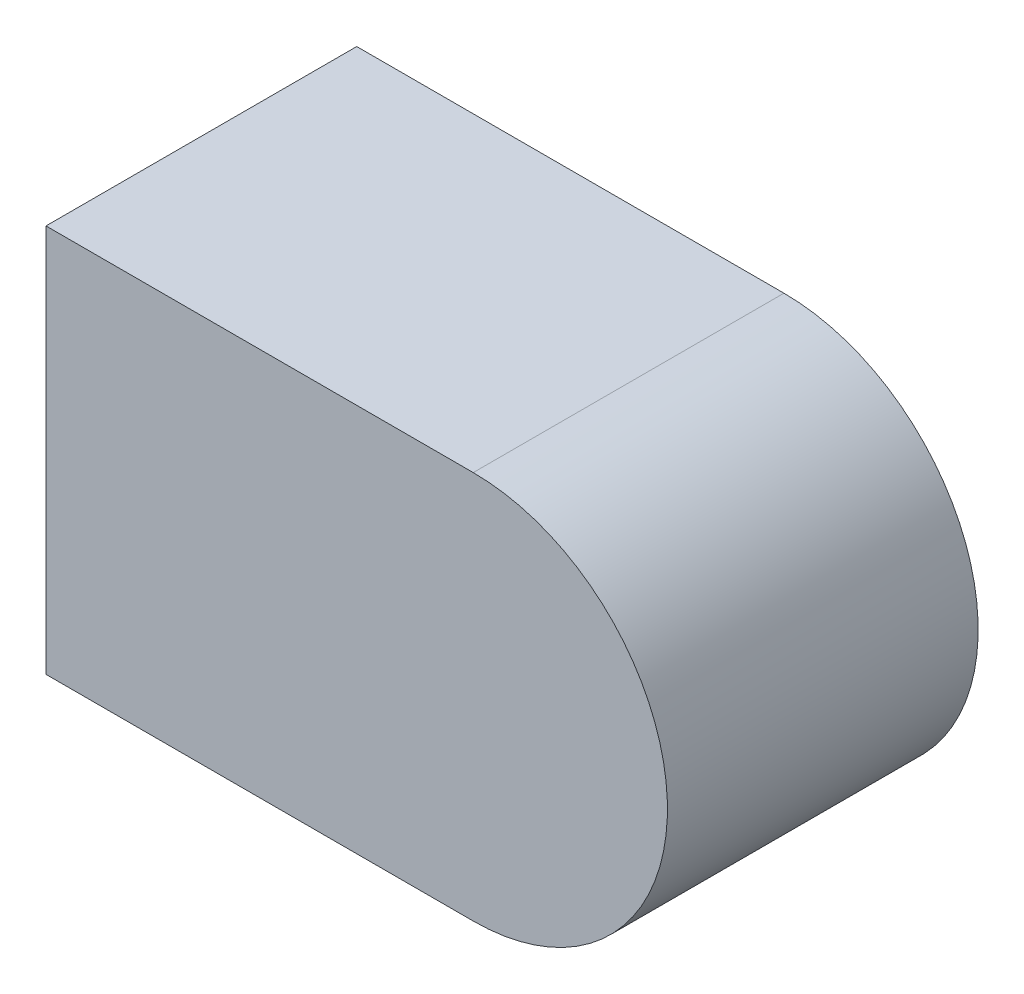
ISO-10303-21;
HEADER;
FILE_DESCRIPTION(('STEP AP214'),'2;1');
FILE_NAME('part.step','',(''),(''),'','','');
FILE_SCHEMA(('AUTOMOTIVE_DESIGN { 1 0 10303 214 1 1 1 1 }'));
ENDSEC;
DATA;
#1=APPLICATION_CONTEXT('core data for automotive mechanical design processes');
#2=APPLICATION_PROTOCOL_DEFINITION('international standard','automotive_design',2000,#1);
#3=PRODUCT_CONTEXT('',#1,'mechanical');
#4=PRODUCT('Part','Part','',(#3));
#5=PRODUCT_RELATED_PRODUCT_CATEGORY('part','',(#4));
#6=PRODUCT_DEFINITION_FORMATION('','',#4);
#7=PRODUCT_DEFINITION_CONTEXT('part definition',#1,'design');
#8=PRODUCT_DEFINITION('design','',#6,#7);
#9=PRODUCT_DEFINITION_SHAPE('','',#8);
#10=(LENGTH_UNIT() NAMED_UNIT(*) SI_UNIT(.MILLI.,.METRE.));
#11=(NAMED_UNIT(*) PLANE_ANGLE_UNIT() SI_UNIT($,.RADIAN.));
#12=(NAMED_UNIT(*) SI_UNIT($,.STERADIAN.) SOLID_ANGLE_UNIT());
#13=UNCERTAINTY_MEASURE_WITH_UNIT(LENGTH_MEASURE(1.E-05),#10,'distance_accuracy_value','');
#14=(GEOMETRIC_REPRESENTATION_CONTEXT(3) GLOBAL_UNCERTAINTY_ASSIGNED_CONTEXT((#13)) GLOBAL_UNIT_ASSIGNED_CONTEXT((#10,
#11,#12)) REPRESENTATION_CONTEXT('',''));
#15=CARTESIAN_POINT('',(0.,0.,0.));
#16=DIRECTION('',(0.,0.,1.));
#17=DIRECTION('',(1.,0.,0.));
#18=AXIS2_PLACEMENT_3D('',#15,#16,#17);
#19=CARTESIAN_POINT('',(-1.225,-0.5,0.));
#20=DIRECTION('',(0.,0.,1.));
#21=DIRECTION('',(0.,-1.,0.));
#22=AXIS2_PLACEMENT_3D('',#19,#20,#21);
#23=CYLINDRICAL_SURFACE('',#22,0.125);
#24=CARTESIAN_POINT('',(-1.225,-0.5,0.));
#25=DIRECTION('',(0.,0.,1.));
#26=DIRECTION('',(0.,-1.,0.));
#27=AXIS2_PLACEMENT_3D('',#24,#25,#26);
#28=CIRCLE('',#27,0.125);
#29=CARTESIAN_POINT('',(-1.225,-0.625,0.));
#30=VERTEX_POINT('',#29);
#31=CARTESIAN_POINT('',(-1.225,-0.375,0.));
#32=VERTEX_POINT('',#31);
#33=EDGE_CURVE('E11',#30,#32,#28,.T.);
#34=ORIENTED_EDGE('',*,*,#33,.T.);
#35=DIRECTION('',(0.,0.,1.));
#36=VECTOR('',#35,1.);
#37=CARTESIAN_POINT('',(-1.225,-0.375,0.));
#38=LINE('',#37,#36);
#39=CARTESIAN_POINT('',(-1.225,-0.375,0.2));
#40=VERTEX_POINT('',#39);
#41=EDGE_CURVE('E24',#32,#40,#38,.T.);
#42=ORIENTED_EDGE('',*,*,#41,.T.);
#43=CARTESIAN_POINT('',(-1.225,-0.5,0.2));
#44=DIRECTION('',(0.,0.,1.));
#45=DIRECTION('',(0.,-1.,0.));
#46=AXIS2_PLACEMENT_3D('',#43,#44,#45);
#47=CIRCLE('',#46,0.125);
#48=CARTESIAN_POINT('',(-1.225,-0.625,0.2));
#49=VERTEX_POINT('',#48);
#50=EDGE_CURVE('E75',#49,#40,#47,.T.);
#51=ORIENTED_EDGE('',*,*,#50,.F.);
#52=DIRECTION('',(0.,0.,1.));
#53=VECTOR('',#52,1.);
#54=CARTESIAN_POINT('',(-1.225,-0.625,0.));
#55=LINE('',#54,#53);
#56=EDGE_CURVE('E86',#30,#49,#55,.T.);
#57=ORIENTED_EDGE('',*,*,#56,.F.);
#58=EDGE_LOOP('',(#34,#42,#51,#57));
#59=FACE_BOUND('',#58,.T.);
#60=ADVANCED_FACE('F17',(#59),#23,.T.);
#61=CARTESIAN_POINT('',(-1.5,-0.625,0.));
#62=DIRECTION('',(0.,-1.,0.));
#63=DIRECTION('',(1.,0.,0.));
#64=AXIS2_PLACEMENT_3D('',#61,#62,#63);
#65=PLANE('',#64);
#66=DIRECTION('',(1.,0.,0.));
#67=VECTOR('',#66,1.);
#68=CARTESIAN_POINT('',(-1.5,-0.625,0.));
#69=LINE('',#68,#67);
#70=CARTESIAN_POINT('',(-1.5,-0.625,0.));
#71=VERTEX_POINT('',#70);
#72=EDGE_CURVE('E83',#71,#30,#69,.T.);
#73=ORIENTED_EDGE('',*,*,#72,.T.);
#74=ORIENTED_EDGE('',*,*,#56,.T.);
#75=DIRECTION('',(1.,0.,0.));
#76=VECTOR('',#75,1.);
#77=CARTESIAN_POINT('',(-1.5,-0.625,0.2));
#78=LINE('',#77,#76);
#79=CARTESIAN_POINT('',(-1.5,-0.625,0.2));
#80=VERTEX_POINT('',#79);
#81=EDGE_CURVE('E81',#80,#49,#78,.T.);
#82=ORIENTED_EDGE('',*,*,#81,.F.);
#83=DIRECTION('',(0.,0.,1.));
#84=VECTOR('',#83,1.);
#85=CARTESIAN_POINT('',(-1.5,-0.625,0.));
#86=LINE('',#85,#84);
#87=EDGE_CURVE('E61',#71,#80,#86,.T.);
#88=ORIENTED_EDGE('',*,*,#87,.F.);
#89=EDGE_LOOP('',(#73,#74,#82,#88));
#90=FACE_BOUND('',#89,.T.);
#91=ADVANCED_FACE('F91',(#90),#65,.T.);
#92=CARTESIAN_POINT('',(-1.5,-0.375,0.));
#93=DIRECTION('',(-1.,0.,0.));
#94=DIRECTION('',(0.,-1.,0.));
#95=AXIS2_PLACEMENT_3D('',#92,#93,#94);
#96=PLANE('',#95);
#97=DIRECTION('',(0.,-1.,0.));
#98=VECTOR('',#97,1.);
#99=CARTESIAN_POINT('',(-1.5,-0.375,0.));
#100=LINE('',#99,#98);
#101=CARTESIAN_POINT('',(-1.5,-0.375,0.));
#102=VERTEX_POINT('',#101);
#103=EDGE_CURVE('E65',#102,#71,#100,.T.);
#104=ORIENTED_EDGE('',*,*,#103,.T.);
#105=ORIENTED_EDGE('',*,*,#87,.T.);
#106=DIRECTION('',(0.,-1.,0.));
#107=VECTOR('',#106,1.);
#108=CARTESIAN_POINT('',(-1.5,-0.375,0.2));
#109=LINE('',#108,#107);
#110=CARTESIAN_POINT('',(-1.5,-0.375,0.2));
#111=VERTEX_POINT('',#110);
#112=EDGE_CURVE('E54',#111,#80,#109,.T.);
#113=ORIENTED_EDGE('',*,*,#112,.F.);
#114=DIRECTION('',(0.,0.,1.));
#115=VECTOR('',#114,1.);
#116=CARTESIAN_POINT('',(-1.5,-0.375,0.));
#117=LINE('',#116,#115);
#118=EDGE_CURVE('E58',#102,#111,#117,.T.);
#119=ORIENTED_EDGE('',*,*,#118,.F.);
#120=EDGE_LOOP('',(#104,#105,#113,#119));
#121=FACE_BOUND('',#120,.T.);
#122=ADVANCED_FACE('F57',(#121),#96,.T.);
#123=CARTESIAN_POINT('',(-1.225,-0.375,0.));
#124=DIRECTION('',(0.,1.,0.));
#125=DIRECTION('',(-1.,0.,0.));
#126=AXIS2_PLACEMENT_3D('',#123,#124,#125);
#127=PLANE('',#126);
#128=DIRECTION('',(-1.,0.,0.));
#129=VECTOR('',#128,1.);
#130=CARTESIAN_POINT('',(-1.225,-0.375,0.));
#131=LINE('',#130,#129);
#132=EDGE_CURVE('E71',#32,#102,#131,.T.);
#133=ORIENTED_EDGE('',*,*,#132,.T.);
#134=ORIENTED_EDGE('',*,*,#118,.T.);
#135=DIRECTION('',(-1.,0.,0.));
#136=VECTOR('',#135,1.);
#137=CARTESIAN_POINT('',(-1.225,-0.375,0.2));
#138=LINE('',#137,#136);
#139=EDGE_CURVE('E70',#40,#111,#138,.T.);
#140=ORIENTED_EDGE('',*,*,#139,.F.);
#141=ORIENTED_EDGE('',*,*,#41,.F.);
#142=EDGE_LOOP('',(#133,#134,#140,#141));
#143=FACE_BOUND('',#142,.T.);
#144=ADVANCED_FACE('F69',(#143),#127,.T.);
#145=CARTESIAN_POINT('',(-1.3,-0.5,0.2));
#146=DIRECTION('',(0.,0.,1.));
#147=DIRECTION('',(1.,0.,0.));
#148=AXIS2_PLACEMENT_3D('',#145,#146,#147);
#149=PLANE('',#148);
#150=ORIENTED_EDGE('',*,*,#139,.T.);
#151=ORIENTED_EDGE('',*,*,#112,.T.);
#152=ORIENTED_EDGE('',*,*,#81,.T.);
#153=ORIENTED_EDGE('',*,*,#50,.T.);
#154=EDGE_LOOP('',(#150,#151,#152,#153));
#155=FACE_BOUND('',#154,.T.);
#156=ADVANCED_FACE('F74',(#155),#149,.T.);
#157=CARTESIAN_POINT('',(-1.3,-0.5,0.));
#158=DIRECTION('',(0.,0.,1.));
#159=DIRECTION('',(1.,0.,0.));
#160=AXIS2_PLACEMENT_3D('',#157,#158,#159);
#161=PLANE('',#160);
#162=ORIENTED_EDGE('',*,*,#132,.F.);
#163=ORIENTED_EDGE('',*,*,#33,.F.);
#164=ORIENTED_EDGE('',*,*,#72,.F.);
#165=ORIENTED_EDGE('',*,*,#103,.F.);
#166=EDGE_LOOP('',(#162,#163,#164,#165));
#167=FACE_BOUND('',#166,.T.);
#168=ADVANCED_FACE('F89',(#167),#161,.F.);
#169=CLOSED_SHELL('',(#60,#91,#122,#144,#156,#168));
#170=MANIFOLD_SOLID_BREP('B1',#169);
#171=ADVANCED_BREP_SHAPE_REPRESENTATION('',(#18,#170),#14);
#172=SHAPE_DEFINITION_REPRESENTATION(#9,#171);
ENDSEC;
END-ISO-10303-21;
